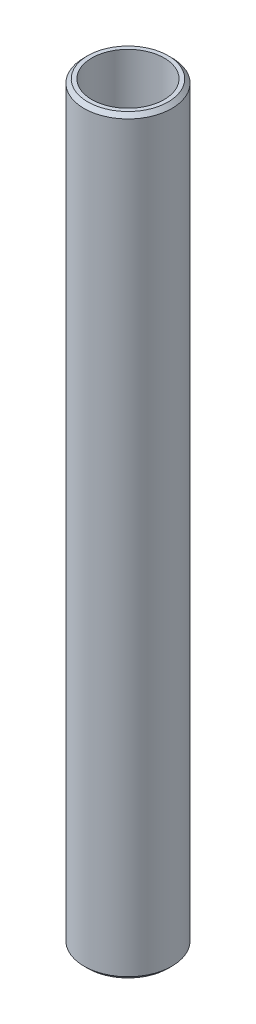
ISO-10303-21;
HEADER;
FILE_DESCRIPTION(('STEP AP214'),'2;1');
FILE_NAME('part.step','',(''),(''),'','','');
FILE_SCHEMA(('AUTOMOTIVE_DESIGN { 1 0 10303 214 1 1 1 1 }'));
ENDSEC;
DATA;
#1=APPLICATION_CONTEXT('core data for automotive mechanical design processes');
#2=APPLICATION_PROTOCOL_DEFINITION('international standard','automotive_design',2000,#1);
#3=PRODUCT_CONTEXT('',#1,'mechanical');
#4=PRODUCT('Part','Part','',(#3));
#5=PRODUCT_RELATED_PRODUCT_CATEGORY('part','',(#4));
#6=PRODUCT_DEFINITION_FORMATION('','',#4);
#7=PRODUCT_DEFINITION_CONTEXT('part definition',#1,'design');
#8=PRODUCT_DEFINITION('design','',#6,#7);
#9=PRODUCT_DEFINITION_SHAPE('','',#8);
#10=(LENGTH_UNIT() NAMED_UNIT(*) SI_UNIT(.MILLI.,.METRE.));
#11=(NAMED_UNIT(*) PLANE_ANGLE_UNIT() SI_UNIT($,.RADIAN.));
#12=(NAMED_UNIT(*) SI_UNIT($,.STERADIAN.) SOLID_ANGLE_UNIT());
#13=UNCERTAINTY_MEASURE_WITH_UNIT(LENGTH_MEASURE(1.E-05),#10,'distance_accuracy_value','');
#14=(GEOMETRIC_REPRESENTATION_CONTEXT(3) GLOBAL_UNCERTAINTY_ASSIGNED_CONTEXT((#13)) GLOBAL_UNIT_ASSIGNED_CONTEXT((#10,
#11,#12)) REPRESENTATION_CONTEXT('',''));
#15=CARTESIAN_POINT('',(0.,0.,0.));
#16=DIRECTION('',(0.,0.,1.));
#17=DIRECTION('',(1.,0.,0.));
#18=AXIS2_PLACEMENT_3D('',#15,#16,#17);
#19=CARTESIAN_POINT('',(0.,598.066929256206,0.));
#20=DIRECTION('',(0.,-1.,0.));
#21=DIRECTION('',(0.,0.,-1.));
#22=AXIS2_PLACEMENT_3D('',#19,#20,#21);
#23=CYLINDRICAL_SURFACE('',#22,35.);
#24=CARTESIAN_POINT('',(0.,595.07094447465,0.));
#25=DIRECTION('',(0.,1.,0.));
#26=DIRECTION('',(0.,0.,1.));
#27=AXIS2_PLACEMENT_3D('',#24,#25,#26);
#28=CIRCLE('',#27,35.);
#29=CARTESIAN_POINT('',(0.,595.07094447465,35.));
#30=VERTEX_POINT('',#29);
#31=EDGE_CURVE('E50',#30,#30,#28,.F.);
#32=ORIENTED_EDGE('',*,*,#31,.T.);
#33=EDGE_LOOP('',(#32));
#34=FACE_BOUND('',#33,.T.);
#35=CARTESIAN_POINT('',(0.,2.99598478155561,0.));
#36=DIRECTION('',(0.,1.,0.));
#37=DIRECTION('',(0.,0.,1.));
#38=AXIS2_PLACEMENT_3D('',#35,#36,#37);
#39=CIRCLE('',#38,35.);
#40=CARTESIAN_POINT('',(0.,2.9959847815556,35.));
#41=VERTEX_POINT('',#40);
#42=EDGE_CURVE('E51',#41,#41,#39,.T.);
#43=ORIENTED_EDGE('',*,*,#42,.T.);
#44=EDGE_LOOP('',(#43));
#45=FACE_BOUND('',#44,.T.);
#46=ADVANCED_FACE('F39',(#34,#45),#23,.T.);
#47=CARTESIAN_POINT('',(0.,598.066929256206,0.));
#48=DIRECTION('',(0.,1.,0.));
#49=DIRECTION('',(0.,0.,1.));
#50=AXIS2_PLACEMENT_3D('',#47,#48,#49);
#51=PLANE('',#50);
#52=CARTESIAN_POINT('',(0.,598.066929256206,0.));
#53=DIRECTION('',(0.,1.,0.));
#54=DIRECTION('',(0.,0.,1.));
#55=AXIS2_PLACEMENT_3D('',#52,#53,#54);
#56=CIRCLE('',#55,32.0040152184442);
#57=CARTESIAN_POINT('',(0.,598.066929256206,32.0040152184442));
#58=VERTEX_POINT('',#57);
#59=EDGE_CURVE('E54',#58,#58,#56,.T.);
#60=ORIENTED_EDGE('',*,*,#59,.T.);
#61=EDGE_LOOP('',(#60));
#62=FACE_BOUND('',#61,.T.);
#63=CARTESIAN_POINT('',(0.,598.066929256206,0.));
#64=DIRECTION('',(0.,1.,0.));
#65=DIRECTION('',(0.,0.,1.));
#66=AXIS2_PLACEMENT_3D('',#63,#64,#65);
#67=CIRCLE('',#66,28.7922758493377);
#68=CARTESIAN_POINT('',(0.,598.066929256206,28.7922758493377));
#69=VERTEX_POINT('',#68);
#70=EDGE_CURVE('E58',#69,#69,#67,.T.);
#71=ORIENTED_EDGE('',*,*,#70,.F.);
#72=EDGE_LOOP('',(#71));
#73=FACE_BOUND('',#72,.T.);
#74=ADVANCED_FACE('F69',(#62,#73),#51,.T.);
#75=CARTESIAN_POINT('',(0.,0.,0.));
#76=DIRECTION('',(0.,1.,0.));
#77=DIRECTION('',(0.,0.,1.));
#78=AXIS2_PLACEMENT_3D('',#75,#76,#77);
#79=PLANE('',#78);
#80=CARTESIAN_POINT('',(0.,0.,0.));
#81=DIRECTION('',(0.,1.,0.));
#82=DIRECTION('',(0.,0.,1.));
#83=AXIS2_PLACEMENT_3D('',#80,#81,#82);
#84=CIRCLE('',#83,32.0040152184444);
#85=CARTESIAN_POINT('',(0.,0.,32.0040152184444));
#86=VERTEX_POINT('',#85);
#87=EDGE_CURVE('E10',#86,#86,#84,.F.);
#88=ORIENTED_EDGE('',*,*,#87,.T.);
#89=EDGE_LOOP('',(#88));
#90=FACE_BOUND('',#89,.T.);
#91=CARTESIAN_POINT('',(0.,0.,0.));
#92=DIRECTION('',(0.,1.,0.));
#93=DIRECTION('',(0.,0.,1.));
#94=AXIS2_PLACEMENT_3D('',#91,#92,#93);
#95=CIRCLE('',#94,28.7922758493377);
#96=CARTESIAN_POINT('',(0.,0.,28.7922758493377));
#97=VERTEX_POINT('',#96);
#98=EDGE_CURVE('E63',#97,#97,#95,.T.);
#99=ORIENTED_EDGE('',*,*,#98,.T.);
#100=EDGE_LOOP('',(#99));
#101=FACE_BOUND('',#100,.T.);
#102=ADVANCED_FACE('F75',(#90,#101),#79,.F.);
#103=CARTESIAN_POINT('',(0.,598.066929256206,0.));
#104=DIRECTION('',(0.,-1.,0.));
#105=DIRECTION('',(0.,0.,-1.));
#106=AXIS2_PLACEMENT_3D('',#103,#104,#105);
#107=CYLINDRICAL_SURFACE('',#106,28.7922758493377);
#108=ORIENTED_EDGE('',*,*,#70,.T.);
#109=EDGE_LOOP('',(#108));
#110=FACE_BOUND('',#109,.T.);
#111=ORIENTED_EDGE('',*,*,#98,.F.);
#112=EDGE_LOOP('',(#111));
#113=FACE_BOUND('',#112,.T.);
#114=ADVANCED_FACE('F70',(#110,#113),#107,.F.);
#115=CARTESIAN_POINT('',(0.,598.066929256206,0.));
#116=DIRECTION('',(0.,-1.,0.));
#117=DIRECTION('',(0.,0.,-1.));
#118=AXIS2_PLACEMENT_3D('',#115,#116,#117);
#119=CONICAL_SURFACE('',#118,32.0040152184442,0.785398163397445);
#120=ORIENTED_EDGE('',*,*,#31,.F.);
#121=EDGE_LOOP('',(#120));
#122=FACE_BOUND('',#121,.T.);
#123=ORIENTED_EDGE('',*,*,#59,.F.);
#124=EDGE_LOOP('',(#123));
#125=FACE_BOUND('',#124,.T.);
#126=ADVANCED_FACE('F81',(#122,#125),#119,.T.);
#127=CARTESIAN_POINT('',(0.,2.99598478155561,0.));
#128=DIRECTION('',(0.,1.,0.));
#129=DIRECTION('',(0.,0.,1.));
#130=AXIS2_PLACEMENT_3D('',#127,#128,#129);
#131=CONICAL_SURFACE('',#130,35.,0.785398163397445);
#132=CARTESIAN_POINT('',(0.,0.,32.0040152184444));
#133=CARTESIAN_POINT('',(0.,0.0312081748078723,32.0352233932523));
#134=CARTESIAN_POINT('',(0.,0.0624163496157426,32.0664315680602));
#135=CARTESIAN_POINT('',(0.,0.124832699231483,32.1288479176759));
#136=CARTESIAN_POINT('',(0.,0.156040874039353,32.1600560924838));
#137=CARTESIAN_POINT('',(0.,0.218457223655095,32.2224724420995));
#138=CARTESIAN_POINT('',(0.,0.249665398462967,32.2536806169074));
#139=CARTESIAN_POINT('',(0.,0.312081748078709,32.3160969665231));
#140=CARTESIAN_POINT('',(0.,0.343289922886579,32.347305141331));
#141=CARTESIAN_POINT('',(0.,0.40570627250232,32.4097214909467));
#142=CARTESIAN_POINT('',(0.,0.436914447310192,32.4409296657546));
#143=CARTESIAN_POINT('',(0.,0.499330796925934,32.5033460153704));
#144=CARTESIAN_POINT('',(0.,0.530538971733805,32.5345541901782));
#145=CARTESIAN_POINT('',(0.,0.592955321349547,32.596970539794));
#146=CARTESIAN_POINT('',(0.,0.624163496157417,32.6281787146018));
#147=CARTESIAN_POINT('',(0.,0.686579845773159,32.6905950642176));
#148=CARTESIAN_POINT('',(0.,0.717788020581031,32.7218032390255));
#149=CARTESIAN_POINT('',(0.,0.780204370196772,32.7842195886412));
#150=CARTESIAN_POINT('',(0.,0.811412545004642,32.8154277634491));
#151=CARTESIAN_POINT('',(0.,0.873828894620383,32.8778441130648));
#152=CARTESIAN_POINT('',(0.,0.905037069428255,32.9090522878727));
#153=CARTESIAN_POINT('',(0.,0.967453419043998,32.9714686374884));
#154=CARTESIAN_POINT('',(0.,0.998661593851869,33.0026768122963));
#155=CARTESIAN_POINT('',(0.,1.06107794346761,33.065093161912));
#156=CARTESIAN_POINT('',(0.,1.09228611827548,33.0963013367199));
#157=CARTESIAN_POINT('',(0.,1.15470246789122,33.1587176863356));
#158=CARTESIAN_POINT('',(0.,1.18591064269909,33.1899258611435));
#159=CARTESIAN_POINT('',(0.,1.24832699231484,33.2523422107593));
#160=CARTESIAN_POINT('',(0.,1.27953516712271,33.2835503855671));
#161=CARTESIAN_POINT('',(0.,1.34195151673845,33.3459667351829));
#162=CARTESIAN_POINT('',(0.,1.37315969154632,33.3771749099907));
#163=CARTESIAN_POINT('',(0.,1.43557604116206,33.4395912596065));
#164=CARTESIAN_POINT('',(0.,1.46678421596993,33.4707994344143));
#165=CARTESIAN_POINT('',(0.,1.52920056558567,33.5332157840301));
#166=CARTESIAN_POINT('',(0.,1.56040874039354,33.564423958838));
#167=CARTESIAN_POINT('',(0.,1.62282509000929,33.6268403084537));
#168=CARTESIAN_POINT('',(0.,1.65403326481716,33.6580484832616));
#169=CARTESIAN_POINT('',(0.,1.7164496144329,33.7204648328773));
#170=CARTESIAN_POINT('',(0.,1.74765778924077,33.7516730076852));
#171=CARTESIAN_POINT('',(0.,1.81007413885651,33.8140893573009));
#172=CARTESIAN_POINT('',(0.,1.84128231366438,33.8452975321088));
#173=CARTESIAN_POINT('',(0.,1.90369866328012,33.9077138817245));
#174=CARTESIAN_POINT('',(0.,1.93490683808799,33.9389220565324));
#175=CARTESIAN_POINT('',(0.,1.99732318770374,34.0013384061482));
#176=CARTESIAN_POINT('',(0.,2.02853136251161,34.032546580956));
#177=CARTESIAN_POINT('',(0.,2.09094771212735,34.0949629305718));
#178=CARTESIAN_POINT('',(0.,2.12215588693522,34.1261711053796));
#179=CARTESIAN_POINT('',(0.,2.18457223655096,34.1885874549954));
#180=CARTESIAN_POINT('',(0.,2.21578041135883,34.2197956298032));
#181=CARTESIAN_POINT('',(0.,2.27819676097457,34.282211979419));
#182=CARTESIAN_POINT('',(0.,2.30940493578245,34.3134201542269));
#183=CARTESIAN_POINT('',(0.,2.37182128539819,34.3758365038426));
#184=CARTESIAN_POINT('',(0.,2.40302946020606,34.4070446786505));
#185=CARTESIAN_POINT('',(0.,2.4654458098218,34.4694610282662));
#186=CARTESIAN_POINT('',(0.,2.49665398462967,34.5006692030741));
#187=CARTESIAN_POINT('',(0.,2.55907033424541,34.5630855526898));
#188=CARTESIAN_POINT('',(0.,2.59027850905328,34.5942937274977));
#189=CARTESIAN_POINT('',(0.,2.65269485866903,34.6567100771134));
#190=CARTESIAN_POINT('',(0.,2.6839030334769,34.6879182519213));
#191=CARTESIAN_POINT('',(0.,2.74631938309264,34.750334601537));
#192=CARTESIAN_POINT('',(0.,2.77752755790051,34.7815427763449));
#193=CARTESIAN_POINT('',(0.,2.83994390751625,34.8439591259607));
#194=CARTESIAN_POINT('',(0.,2.87115208232412,34.8751673007685));
#195=CARTESIAN_POINT('',(0.,2.93356843193986,34.9375836503843));
#196=CARTESIAN_POINT('',(0.,2.96477660674773,34.9687918251921));
#197=CARTESIAN_POINT('',(0.,2.9959847815556,35.));
#198=B_SPLINE_CURVE_WITH_KNOTS('',3,(#132,#133,#134,#135,#136,#137,#138,#139,#140,#141,#142,
#143,#144,#145,#146,#147,#148,#149,#150,#151,#152,#153,#154,#155,#156,#157,#158,#159,#160,#161,
#162,#163,#164,#165,#166,#167,#168,#169,#170,#171,#172,#173,#174,#175,#176,#177,#178,#179,#180,
#181,#182,#183,#184,#185,#186,#187,#188,#189,#190,#191,#192,#193,#194,#195,#196,#197),
.UNSPECIFIED.,.F.,.F.,(4,2,2,2,2,2,2,2,2,2,2,2,2,2,2,2,2,2,2,2,2,2,2,2,2,2,2,2,2,2,2,2,4),(0.,
0.132405072210602,0.264810144421208,0.39721521663181,0.529620288842416,0.662025361053018,
0.79443043326362,0.926835505474226,1.05924057768483,1.19164564989543,1.32405072210604,
1.45645579431664,1.58886086652724,1.72126593873785,1.85367101094845,1.98607608315905,
2.11848115536966,2.25088622758026,2.38329129979086,2.51569637200147,2.64810144421207,
2.78050651642268,2.91291158863328,3.04531666084388,3.17772173305449,3.31012680526509,
3.4425318774757,3.5749369496863,3.7073420218969,3.8397470941075,3.97215216631811,
4.10455723852871,4.23696231073932),.UNSPECIFIED.);
#199=EDGE_CURVE('BSEAM45',#86,#41,#198,.T.);
#200=ORIENTED_EDGE('',*,*,#87,.F.);
#201=ORIENTED_EDGE('',*,*,#42,.F.);
#202=ORIENTED_EDGE('',*,*,#199,.T.);
#203=ORIENTED_EDGE('',*,*,#199,.F.);
#204=EDGE_LOOP('',(#200,#202,#201,#203));
#205=FACE_BOUND('',#204,.T.);
#206=ADVANCED_FACE('F45',(#205),#131,.T.);
#207=CLOSED_SHELL('',(#46,#74,#102,#114,#126,#206));
#208=MANIFOLD_SOLID_BREP('B2',#207);
#209=ADVANCED_BREP_SHAPE_REPRESENTATION('',(#18,#208),#14);
#210=SHAPE_DEFINITION_REPRESENTATION(#9,#209);
ENDSEC;
END-ISO-10303-21;
